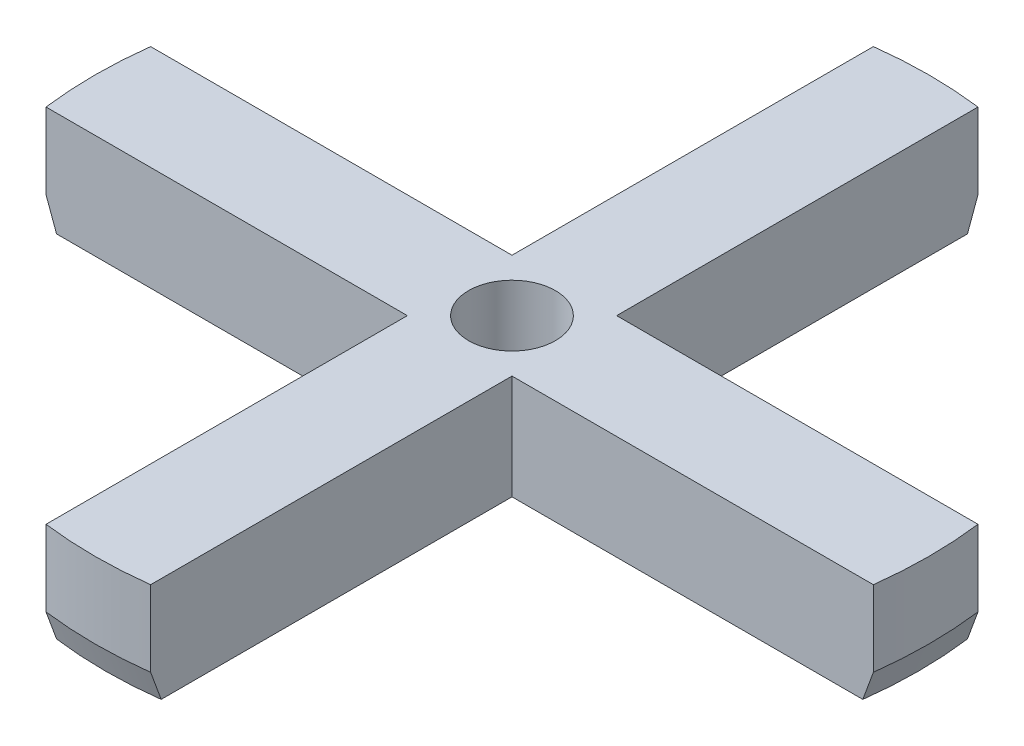
ISO-10303-21;
HEADER;
FILE_DESCRIPTION(('STEP AP214'),'2;1');
FILE_NAME('part.step','',(''),(''),'','','');
FILE_SCHEMA(('AUTOMOTIVE_DESIGN { 1 0 10303 214 1 1 1 1 }'));
ENDSEC;
DATA;
#1=APPLICATION_CONTEXT('core data for automotive mechanical design processes');
#2=APPLICATION_PROTOCOL_DEFINITION('international standard','automotive_design',2000,#1);
#3=PRODUCT_CONTEXT('',#1,'mechanical');
#4=PRODUCT('Part','Part','',(#3));
#5=PRODUCT_RELATED_PRODUCT_CATEGORY('part','',(#4));
#6=PRODUCT_DEFINITION_FORMATION('','',#4);
#7=PRODUCT_DEFINITION_CONTEXT('part definition',#1,'design');
#8=PRODUCT_DEFINITION('design','',#6,#7);
#9=PRODUCT_DEFINITION_SHAPE('','',#8);
#10=(LENGTH_UNIT() NAMED_UNIT(*) SI_UNIT(.MILLI.,.METRE.));
#11=(NAMED_UNIT(*) PLANE_ANGLE_UNIT() SI_UNIT($,.RADIAN.));
#12=(NAMED_UNIT(*) SI_UNIT($,.STERADIAN.) SOLID_ANGLE_UNIT());
#13=UNCERTAINTY_MEASURE_WITH_UNIT(LENGTH_MEASURE(1.E-05),#10,'distance_accuracy_value','');
#14=(GEOMETRIC_REPRESENTATION_CONTEXT(3) GLOBAL_UNCERTAINTY_ASSIGNED_CONTEXT((#13)) GLOBAL_UNIT_ASSIGNED_CONTEXT((#10,
#11,#12)) REPRESENTATION_CONTEXT('',''));
#15=CARTESIAN_POINT('',(0.,0.,0.));
#16=DIRECTION('',(0.,0.,1.));
#17=DIRECTION('',(1.,0.,0.));
#18=AXIS2_PLACEMENT_3D('',#15,#16,#17);
#19=CARTESIAN_POINT('',(0.,10.,0.));
#20=DIRECTION('',(0.,-1.,0.));
#21=DIRECTION('',(0.,0.,-1.));
#22=AXIS2_PLACEMENT_3D('',#19,#20,#21);
#23=PLANE('',#22);
#24=CARTESIAN_POINT('',(0.,10.,0.));
#25=DIRECTION('',(0.,1.,0.));
#26=DIRECTION('',(0.,0.,-1.));
#27=AXIS2_PLACEMENT_3D('',#24,#25,#26);
#28=CIRCLE('',#27,39.85);
#29=CARTESIAN_POINT('',(5.,10.,-39.5350793599811));
#30=VERTEX_POINT('',#29);
#31=CARTESIAN_POINT('',(-5.,10.,-39.5350793599811));
#32=VERTEX_POINT('',#31);
#33=EDGE_CURVE('E163',#30,#32,#28,.T.);
#34=ORIENTED_EDGE('',*,*,#33,.T.);
#35=DIRECTION('',(0.,0.,1.));
#36=VECTOR('',#35,1.);
#37=CARTESIAN_POINT('',(-5.,10.,-5.));
#38=LINE('',#37,#36);
#39=CARTESIAN_POINT('',(-5.,10.,-5.));
#40=VERTEX_POINT('',#39);
#41=EDGE_CURVE('E153',#32,#40,#38,.T.);
#42=ORIENTED_EDGE('',*,*,#41,.T.);
#43=DIRECTION('',(-1.,0.,0.));
#44=VECTOR('',#43,1.);
#45=CARTESIAN_POINT('',(-39.5350793599811,10.,-5.));
#46=LINE('',#45,#44);
#47=CARTESIAN_POINT('',(-39.5350793599811,10.,-5.));
#48=VERTEX_POINT('',#47);
#49=EDGE_CURVE('E162',#40,#48,#46,.T.);
#50=ORIENTED_EDGE('',*,*,#49,.T.);
#51=CARTESIAN_POINT('',(0.,10.,0.));
#52=DIRECTION('',(0.,1.,0.));
#53=DIRECTION('',(0.,0.,-1.));
#54=AXIS2_PLACEMENT_3D('',#51,#52,#53);
#55=CIRCLE('',#54,39.85);
#56=CARTESIAN_POINT('',(-39.5350793599811,10.,5.00000000000002));
#57=VERTEX_POINT('',#56);
#58=EDGE_CURVE('E305',#48,#57,#55,.T.);
#59=ORIENTED_EDGE('',*,*,#58,.T.);
#60=DIRECTION('',(1.,0.,0.));
#61=VECTOR('',#60,1.);
#62=CARTESIAN_POINT('',(-5.,10.,5.));
#63=LINE('',#62,#61);
#64=CARTESIAN_POINT('',(-5.,10.,5.));
#65=VERTEX_POINT('',#64);
#66=EDGE_CURVE('E378',#57,#65,#63,.T.);
#67=ORIENTED_EDGE('',*,*,#66,.T.);
#68=DIRECTION('',(0.,0.,1.));
#69=VECTOR('',#68,1.);
#70=CARTESIAN_POINT('',(-5.,10.,39.5350793599811));
#71=LINE('',#70,#69);
#72=CARTESIAN_POINT('',(-5.,10.,39.5350793599811));
#73=VERTEX_POINT('',#72);
#74=EDGE_CURVE('E376',#65,#73,#71,.T.);
#75=ORIENTED_EDGE('',*,*,#74,.T.);
#76=CARTESIAN_POINT('',(0.,10.,0.));
#77=DIRECTION('',(0.,1.,0.));
#78=DIRECTION('',(0.,0.,1.));
#79=AXIS2_PLACEMENT_3D('',#76,#77,#78);
#80=CIRCLE('',#79,39.85);
#81=CARTESIAN_POINT('',(5.,10.,39.5350793599811));
#82=VERTEX_POINT('',#81);
#83=EDGE_CURVE('E374',#73,#82,#80,.T.);
#84=ORIENTED_EDGE('',*,*,#83,.T.);
#85=DIRECTION('',(0.,0.,-1.));
#86=VECTOR('',#85,1.);
#87=CARTESIAN_POINT('',(5.,10.,5.00000000000001));
#88=LINE('',#87,#86);
#89=CARTESIAN_POINT('',(5.,10.,5.00000000000001));
#90=VERTEX_POINT('',#89);
#91=EDGE_CURVE('E286',#82,#90,#88,.T.);
#92=ORIENTED_EDGE('',*,*,#91,.T.);
#93=DIRECTION('',(1.,0.,0.));
#94=VECTOR('',#93,1.);
#95=CARTESIAN_POINT('',(39.5350793599811,10.,5.));
#96=LINE('',#95,#94);
#97=CARTESIAN_POINT('',(39.5350793599811,10.,5.));
#98=VERTEX_POINT('',#97);
#99=EDGE_CURVE('E371',#90,#98,#96,.T.);
#100=ORIENTED_EDGE('',*,*,#99,.T.);
#101=CARTESIAN_POINT('',(0.,10.,0.));
#102=DIRECTION('',(0.,1.,0.));
#103=DIRECTION('',(0.,0.,1.));
#104=AXIS2_PLACEMENT_3D('',#101,#102,#103);
#105=CIRCLE('',#104,39.85);
#106=CARTESIAN_POINT('',(39.5350793599811,10.,-4.99999999999999));
#107=VERTEX_POINT('',#106);
#108=EDGE_CURVE('E351',#98,#107,#105,.T.);
#109=ORIENTED_EDGE('',*,*,#108,.T.);
#110=DIRECTION('',(-1.,0.,0.));
#111=VECTOR('',#110,1.);
#112=CARTESIAN_POINT('',(5.,10.,-5.));
#113=LINE('',#112,#111);
#114=CARTESIAN_POINT('',(5.,10.,-5.));
#115=VERTEX_POINT('',#114);
#116=EDGE_CURVE('E368',#107,#115,#113,.T.);
#117=ORIENTED_EDGE('',*,*,#116,.T.);
#118=DIRECTION('',(0.,0.,-1.));
#119=VECTOR('',#118,1.);
#120=CARTESIAN_POINT('',(5.,10.,-39.5350793599811));
#121=LINE('',#120,#119);
#122=EDGE_CURVE('E168',#115,#30,#121,.T.);
#123=ORIENTED_EDGE('',*,*,#122,.T.);
#124=EDGE_LOOP('',(#34,#42,#50,#59,#67,#75,#84,#92,#100,#109,#117,#123));
#125=FACE_BOUND('',#124,.T.);
#126=CARTESIAN_POINT('',(0.,10.,0.));
#127=DIRECTION('',(0.,1.,0.));
#128=DIRECTION('',(0.,0.,1.));
#129=AXIS2_PLACEMENT_3D('',#126,#127,#128);
#130=CIRCLE('',#129,4.15);
#131=CARTESIAN_POINT('',(0.,10.,4.15));
#132=VERTEX_POINT('',#131);
#133=EDGE_CURVE('E362',#132,#132,#130,.T.);
#134=ORIENTED_EDGE('',*,*,#133,.F.);
#135=EDGE_LOOP('',(#134));
#136=FACE_BOUND('',#135,.T.);
#137=ADVANCED_FACE('F35',(#125,#136),#23,.F.);
#138=CARTESIAN_POINT('',(0.,0.,0.));
#139=DIRECTION('',(0.,-1.,0.));
#140=DIRECTION('',(0.,0.,-1.));
#141=AXIS2_PLACEMENT_3D('',#138,#139,#140);
#142=PLANE('',#141);
#143=DIRECTION('',(1.,0.,0.));
#144=VECTOR('',#143,1.);
#145=CARTESIAN_POINT('',(-5.,0.,5.));
#146=LINE('',#145,#144);
#147=CARTESIAN_POINT('',(-38.5269061825629,0.,5.));
#148=VERTEX_POINT('',#147);
#149=CARTESIAN_POINT('',(-5.,0.,5.));
#150=VERTEX_POINT('',#149);
#151=EDGE_CURVE('E311',#148,#150,#146,.T.);
#152=ORIENTED_EDGE('',*,*,#151,.F.);
#153=CARTESIAN_POINT('',(0.,0.,0.));
#154=DIRECTION('',(0.,-1.,0.));
#155=DIRECTION('',(0.,0.,-1.));
#156=AXIS2_PLACEMENT_3D('',#153,#154,#155);
#157=CIRCLE('',#156,38.85);
#158=CARTESIAN_POINT('',(-38.5269061825629,0.,-5.));
#159=VERTEX_POINT('',#158);
#160=EDGE_CURVE('E224',#148,#159,#157,.T.);
#161=ORIENTED_EDGE('',*,*,#160,.T.);
#162=DIRECTION('',(-1.,0.,0.));
#163=VECTOR('',#162,1.);
#164=CARTESIAN_POINT('',(-39.5350793599811,0.,-5.));
#165=LINE('',#164,#163);
#166=CARTESIAN_POINT('',(-5.,0.,-5.));
#167=VERTEX_POINT('',#166);
#168=EDGE_CURVE('E320',#167,#159,#165,.T.);
#169=ORIENTED_EDGE('',*,*,#168,.F.);
#170=DIRECTION('',(0.,0.,1.));
#171=VECTOR('',#170,1.);
#172=CARTESIAN_POINT('',(-5.,0.,-5.));
#173=LINE('',#172,#171);
#174=CARTESIAN_POINT('',(-5.,0.,-38.5269061825629));
#175=VERTEX_POINT('',#174);
#176=EDGE_CURVE('E324',#175,#167,#173,.T.);
#177=ORIENTED_EDGE('',*,*,#176,.F.);
#178=CARTESIAN_POINT('',(0.,0.,0.));
#179=DIRECTION('',(0.,-1.,0.));
#180=DIRECTION('',(0.,0.,-1.));
#181=AXIS2_PLACEMENT_3D('',#178,#179,#180);
#182=CIRCLE('',#181,38.85);
#183=CARTESIAN_POINT('',(5.,0.,-38.5269061825629));
#184=VERTEX_POINT('',#183);
#185=EDGE_CURVE('E360',#175,#184,#182,.T.);
#186=ORIENTED_EDGE('',*,*,#185,.T.);
#187=DIRECTION('',(0.,0.,-1.));
#188=VECTOR('',#187,1.);
#189=CARTESIAN_POINT('',(5.,0.,-39.5350793599811));
#190=LINE('',#189,#188);
#191=CARTESIAN_POINT('',(5.,0.,-5.));
#192=VERTEX_POINT('',#191);
#193=EDGE_CURVE('E172',#192,#184,#190,.T.);
#194=ORIENTED_EDGE('',*,*,#193,.F.);
#195=DIRECTION('',(-1.,0.,0.));
#196=VECTOR('',#195,1.);
#197=CARTESIAN_POINT('',(5.,0.,-5.));
#198=LINE('',#197,#196);
#199=CARTESIAN_POINT('',(38.5269061825629,0.,-5.));
#200=VERTEX_POINT('',#199);
#201=EDGE_CURVE('E332',#200,#192,#198,.T.);
#202=ORIENTED_EDGE('',*,*,#201,.F.);
#203=CARTESIAN_POINT('',(0.,0.,0.));
#204=DIRECTION('',(0.,-1.,0.));
#205=DIRECTION('',(0.,0.,-1.));
#206=AXIS2_PLACEMENT_3D('',#203,#204,#205);
#207=CIRCLE('',#206,38.85);
#208=CARTESIAN_POINT('',(38.5269061825629,0.,5.));
#209=VERTEX_POINT('',#208);
#210=EDGE_CURVE('E411',#200,#209,#207,.T.);
#211=ORIENTED_EDGE('',*,*,#210,.T.);
#212=DIRECTION('',(1.,0.,0.));
#213=VECTOR('',#212,1.);
#214=CARTESIAN_POINT('',(39.5350793599811,0.,5.));
#215=LINE('',#214,#213);
#216=CARTESIAN_POINT('',(5.,0.,5.00000000000001));
#217=VERTEX_POINT('',#216);
#218=EDGE_CURVE('E329',#217,#209,#215,.T.);
#219=ORIENTED_EDGE('',*,*,#218,.F.);
#220=DIRECTION('',(0.,0.,-1.));
#221=VECTOR('',#220,1.);
#222=CARTESIAN_POINT('',(5.,0.,5.00000000000001));
#223=LINE('',#222,#221);
#224=CARTESIAN_POINT('',(5.,0.,38.5269061825628));
#225=VERTEX_POINT('',#224);
#226=EDGE_CURVE('E322',#225,#217,#223,.T.);
#227=ORIENTED_EDGE('',*,*,#226,.F.);
#228=CARTESIAN_POINT('',(0.,0.,0.));
#229=DIRECTION('',(0.,-1.,0.));
#230=DIRECTION('',(0.,0.,-1.));
#231=AXIS2_PLACEMENT_3D('',#228,#229,#230);
#232=CIRCLE('',#231,38.85);
#233=CARTESIAN_POINT('',(-5.,0.,38.5269061825628));
#234=VERTEX_POINT('',#233);
#235=EDGE_CURVE('E193',#225,#234,#232,.T.);
#236=ORIENTED_EDGE('',*,*,#235,.T.);
#237=DIRECTION('',(0.,0.,1.));
#238=VECTOR('',#237,1.);
#239=CARTESIAN_POINT('',(-5.,0.,39.5350793599811));
#240=LINE('',#239,#238);
#241=EDGE_CURVE('E319',#150,#234,#240,.T.);
#242=ORIENTED_EDGE('',*,*,#241,.F.);
#243=EDGE_LOOP('',(#152,#161,#169,#177,#186,#194,#202,#211,#219,#227,#236,#242));
#244=FACE_BOUND('',#243,.T.);
#245=CARTESIAN_POINT('',(0.,0.,0.));
#246=DIRECTION('',(0.,1.,0.));
#247=DIRECTION('',(0.,0.,1.));
#248=AXIS2_PLACEMENT_3D('',#245,#246,#247);
#249=CIRCLE('',#248,4.15);
#250=CARTESIAN_POINT('',(0.,0.,4.15));
#251=VERTEX_POINT('',#250);
#252=EDGE_CURVE('E364',#251,#251,#249,.T.);
#253=ORIENTED_EDGE('',*,*,#252,.T.);
#254=EDGE_LOOP('',(#253));
#255=FACE_BOUND('',#254,.T.);
#256=ADVANCED_FACE('F315',(#244,#255),#142,.T.);
#257=CARTESIAN_POINT('',(0.,10.,0.));
#258=DIRECTION('',(0.,-1.,0.));
#259=DIRECTION('',(0.,0.,-1.));
#260=AXIS2_PLACEMENT_3D('',#257,#258,#259);
#261=CYLINDRICAL_SURFACE('',#260,39.85);
#262=DIRECTION('',(0.,-1.,0.));
#263=VECTOR('',#262,1.);
#264=CARTESIAN_POINT('',(5.,10.,-39.5350793599811));
#265=LINE('',#264,#263);
#266=CARTESIAN_POINT('',(5.,2.74747741945455,-39.5350793599811));
#267=VERTEX_POINT('',#266);
#268=EDGE_CURVE('E336',#30,#267,#265,.T.);
#269=ORIENTED_EDGE('',*,*,#268,.T.);
#270=CARTESIAN_POINT('',(0.,2.74747741945455,0.));
#271=DIRECTION('',(0.,-1.,0.));
#272=DIRECTION('',(0.,0.,-1.));
#273=AXIS2_PLACEMENT_3D('',#270,#271,#272);
#274=CIRCLE('',#273,39.85);
#275=CARTESIAN_POINT('',(-5.,2.74747741945455,-39.5350793599811));
#276=VERTEX_POINT('',#275);
#277=EDGE_CURVE('E177',#267,#276,#274,.F.);
#278=ORIENTED_EDGE('',*,*,#277,.T.);
#279=DIRECTION('',(0.,-1.,0.));
#280=VECTOR('',#279,1.);
#281=CARTESIAN_POINT('',(-5.,10.,-39.5350793599811));
#282=LINE('',#281,#280);
#283=EDGE_CURVE('E157',#32,#276,#282,.T.);
#284=ORIENTED_EDGE('',*,*,#283,.F.);
#285=ORIENTED_EDGE('',*,*,#33,.F.);
#286=EDGE_LOOP('',(#269,#278,#284,#285));
#287=FACE_BOUND('',#286,.T.);
#288=ADVANCED_FACE('F175',(#287),#261,.T.);
#289=CARTESIAN_POINT('',(-5.,10.,-5.));
#290=DIRECTION('',(1.,0.,0.));
#291=DIRECTION('',(0.,0.,-1.));
#292=AXIS2_PLACEMENT_3D('',#289,#290,#291);
#293=PLANE('',#292);
#294=ORIENTED_EDGE('',*,*,#283,.T.);
#295=CARTESIAN_POINT('',(-5.,2.74747741945455,-39.5350793599811));
#296=CARTESIAN_POINT('',(-5.,2.28955318332988,-39.3670813815128));
#297=CARTESIAN_POINT('',(-5.,1.83163461364963,-39.1990679608283));
#298=CARTESIAN_POINT('',(-5.,0.915808807164781,-38.8630102350223));
#299=CARTESIAN_POINT('',(-5.,0.457901570360174,-38.6949659299007));
#300=CARTESIAN_POINT('',(-5.,0.,-38.5269061825629));
#301=B_SPLINE_CURVE_WITH_KNOTS('',3,(#295,#296,#297,#298,#299,#300),.UNSPECIFIED.,.F.,.F.,(4,2,
4),(0.,1.46330493537498,2.92660987079226),.UNSPECIFIED.);
#302=EDGE_CURVE('E227',#276,#175,#301,.T.);
#303=ORIENTED_EDGE('',*,*,#302,.T.);
#304=ORIENTED_EDGE('',*,*,#176,.T.);
#305=DIRECTION('',(0.,-1.,0.));
#306=VECTOR('',#305,1.);
#307=CARTESIAN_POINT('',(-5.,10.,-5.));
#308=LINE('',#307,#306);
#309=EDGE_CURVE('E159',#40,#167,#308,.T.);
#310=ORIENTED_EDGE('',*,*,#309,.F.);
#311=ORIENTED_EDGE('',*,*,#41,.F.);
#312=EDGE_LOOP('',(#294,#303,#304,#310,#311));
#313=FACE_BOUND('',#312,.T.);
#314=ADVANCED_FACE('F155',(#313),#293,.F.);
#315=CARTESIAN_POINT('',(-39.5350793599811,10.,-5.));
#316=DIRECTION('',(0.,0.,1.));
#317=DIRECTION('',(1.,0.,0.));
#318=AXIS2_PLACEMENT_3D('',#315,#316,#317);
#319=PLANE('',#318);
#320=ORIENTED_EDGE('',*,*,#168,.T.);
#321=CARTESIAN_POINT('',(-38.5269061825629,0.,-5.));
#322=CARTESIAN_POINT('',(-38.6949659299006,0.457901570360186,-5.));
#323=CARTESIAN_POINT('',(-38.8630102350223,0.915808807164806,-5.));
#324=CARTESIAN_POINT('',(-39.1990679608283,1.83163461364968,-5.));
#325=CARTESIAN_POINT('',(-39.3670813815128,2.28955318332994,-5.));
#326=CARTESIAN_POINT('',(-39.5350793599811,2.74747741945462,-5.));
#327=B_SPLINE_CURVE_WITH_KNOTS('',3,(#321,#322,#323,#324,#325,#326),.UNSPECIFIED.,.F.,.F.,(4,2,
4),(0.,1.46330493541731,2.92660987079233),.UNSPECIFIED.);
#328=CARTESIAN_POINT('',(-39.5350793599811,2.74747741945462,-5.));
#329=VERTEX_POINT('',#328);
#330=EDGE_CURVE('E218',#159,#329,#327,.T.);
#331=ORIENTED_EDGE('',*,*,#330,.T.);
#332=DIRECTION('',(0.,-1.,0.));
#333=VECTOR('',#332,1.);
#334=CARTESIAN_POINT('',(-39.5350793599811,10.,-5.));
#335=LINE('',#334,#333);
#336=EDGE_CURVE('E183',#48,#329,#335,.T.);
#337=ORIENTED_EDGE('',*,*,#336,.F.);
#338=ORIENTED_EDGE('',*,*,#49,.F.);
#339=ORIENTED_EDGE('',*,*,#309,.T.);
#340=EDGE_LOOP('',(#320,#331,#337,#338,#339));
#341=FACE_BOUND('',#340,.T.);
#342=ADVANCED_FACE('F210',(#341),#319,.F.);
#343=CARTESIAN_POINT('',(0.,10.,0.));
#344=DIRECTION('',(0.,-1.,0.));
#345=DIRECTION('',(0.,0.,-1.));
#346=AXIS2_PLACEMENT_3D('',#343,#344,#345);
#347=CYLINDRICAL_SURFACE('',#346,39.85);
#348=ORIENTED_EDGE('',*,*,#336,.T.);
#349=CARTESIAN_POINT('',(0.,2.74747741945462,0.));
#350=DIRECTION('',(0.,-1.,0.));
#351=DIRECTION('',(0.,0.,-1.));
#352=AXIS2_PLACEMENT_3D('',#349,#350,#351);
#353=CIRCLE('',#352,39.85);
#354=CARTESIAN_POINT('',(-39.5350793599811,2.74747741945462,5.00000000000002));
#355=VERTEX_POINT('',#354);
#356=EDGE_CURVE('E178',#329,#355,#353,.F.);
#357=ORIENTED_EDGE('',*,*,#356,.T.);
#358=DIRECTION('',(0.,-1.,0.));
#359=VECTOR('',#358,1.);
#360=CARTESIAN_POINT('',(-39.5350793599811,10.,5.00000000000002));
#361=LINE('',#360,#359);
#362=EDGE_CURVE('E298',#57,#355,#361,.T.);
#363=ORIENTED_EDGE('',*,*,#362,.F.);
#364=ORIENTED_EDGE('',*,*,#58,.F.);
#365=EDGE_LOOP('',(#348,#357,#363,#364));
#366=FACE_BOUND('',#365,.T.);
#367=ADVANCED_FACE('F204',(#366),#347,.T.);
#368=CARTESIAN_POINT('',(-5.,10.,5.));
#369=DIRECTION('',(0.,0.,-1.));
#370=DIRECTION('',(-1.,0.,0.));
#371=AXIS2_PLACEMENT_3D('',#368,#369,#370);
#372=PLANE('',#371);
#373=ORIENTED_EDGE('',*,*,#362,.T.);
#374=CARTESIAN_POINT('',(-39.5350793599811,2.74747741945462,5.00000000000002));
#375=CARTESIAN_POINT('',(-39.3670813815128,2.28955318332993,5.00000000000001));
#376=CARTESIAN_POINT('',(-39.1990679608283,1.83163461364968,5.00000000000001));
#377=CARTESIAN_POINT('',(-38.8630102350223,0.915808807164804,5.));
#378=CARTESIAN_POINT('',(-38.6949659299006,0.457901570360184,5.));
#379=CARTESIAN_POINT('',(-38.5269061825629,0.,5.));
#380=B_SPLINE_CURVE_WITH_KNOTS('',3,(#374,#375,#376,#377,#378,#379),.UNSPECIFIED.,.F.,.F.,(4,2,
4),(0.,1.46330493537502,2.92660987079233),.UNSPECIFIED.);
#381=EDGE_CURVE('E181',#355,#148,#380,.T.);
#382=ORIENTED_EDGE('',*,*,#381,.T.);
#383=ORIENTED_EDGE('',*,*,#151,.T.);
#384=DIRECTION('',(0.,-1.,0.));
#385=VECTOR('',#384,1.);
#386=CARTESIAN_POINT('',(-5.,10.,5.));
#387=LINE('',#386,#385);
#388=EDGE_CURVE('E289',#65,#150,#387,.T.);
#389=ORIENTED_EDGE('',*,*,#388,.F.);
#390=ORIENTED_EDGE('',*,*,#66,.F.);
#391=EDGE_LOOP('',(#373,#382,#383,#389,#390));
#392=FACE_BOUND('',#391,.T.);
#393=ADVANCED_FACE('F199',(#392),#372,.F.);
#394=CARTESIAN_POINT('',(-5.,10.,39.5350793599811));
#395=DIRECTION('',(1.,0.,0.));
#396=DIRECTION('',(0.,0.,-1.));
#397=AXIS2_PLACEMENT_3D('',#394,#395,#396);
#398=PLANE('',#397);
#399=ORIENTED_EDGE('',*,*,#241,.T.);
#400=CARTESIAN_POINT('',(-5.,0.,38.5269061825628));
#401=CARTESIAN_POINT('',(-5.,0.457901570360187,38.6949659299006));
#402=CARTESIAN_POINT('',(-5.,0.915808807164809,38.8630102350223));
#403=CARTESIAN_POINT('',(-5.,1.83163461364969,39.1990679608283));
#404=CARTESIAN_POINT('',(-5.,2.28955318332995,39.3670813815128));
#405=CARTESIAN_POINT('',(-5.,2.74747741945464,39.5350793599811));
#406=B_SPLINE_CURVE_WITH_KNOTS('',3,(#400,#401,#402,#403,#404,#405),.UNSPECIFIED.,.F.,.F.,(4,2,
4),(0.,1.46330493541732,2.92660987079235),.UNSPECIFIED.);
#407=CARTESIAN_POINT('',(-5.,2.74747741945464,39.5350793599811));
#408=VERTEX_POINT('',#407);
#409=EDGE_CURVE('E11',#234,#408,#406,.T.);
#410=ORIENTED_EDGE('',*,*,#409,.T.);
#411=DIRECTION('',(0.,-1.,0.));
#412=VECTOR('',#411,1.);
#413=CARTESIAN_POINT('',(-5.,10.,39.5350793599811));
#414=LINE('',#413,#412);
#415=EDGE_CURVE('E284',#73,#408,#414,.T.);
#416=ORIENTED_EDGE('',*,*,#415,.F.);
#417=ORIENTED_EDGE('',*,*,#74,.F.);
#418=ORIENTED_EDGE('',*,*,#388,.T.);
#419=EDGE_LOOP('',(#399,#410,#416,#417,#418));
#420=FACE_BOUND('',#419,.T.);
#421=ADVANCED_FACE('F203',(#420),#398,.F.);
#422=CARTESIAN_POINT('',(0.,10.,0.));
#423=DIRECTION('',(0.,-1.,0.));
#424=DIRECTION('',(0.,0.,-1.));
#425=AXIS2_PLACEMENT_3D('',#422,#423,#424);
#426=CYLINDRICAL_SURFACE('',#425,39.85);
#427=ORIENTED_EDGE('',*,*,#415,.T.);
#428=CARTESIAN_POINT('',(0.,2.74747741945464,0.));
#429=DIRECTION('',(0.,-1.,0.));
#430=DIRECTION('',(0.,0.,-1.));
#431=AXIS2_PLACEMENT_3D('',#428,#429,#430);
#432=CIRCLE('',#431,39.85);
#433=CARTESIAN_POINT('',(5.,2.74747741945464,39.5350793599811));
#434=VERTEX_POINT('',#433);
#435=EDGE_CURVE('E261',#408,#434,#432,.F.);
#436=ORIENTED_EDGE('',*,*,#435,.T.);
#437=DIRECTION('',(0.,-1.,0.));
#438=VECTOR('',#437,1.);
#439=CARTESIAN_POINT('',(5.,10.,39.5350793599811));
#440=LINE('',#439,#438);
#441=EDGE_CURVE('E282',#82,#434,#440,.T.);
#442=ORIENTED_EDGE('',*,*,#441,.F.);
#443=ORIENTED_EDGE('',*,*,#83,.F.);
#444=EDGE_LOOP('',(#427,#436,#442,#443));
#445=FACE_BOUND('',#444,.T.);
#446=ADVANCED_FACE('F272',(#445),#426,.T.);
#447=CARTESIAN_POINT('',(5.,10.,5.00000000000001));
#448=DIRECTION('',(-1.,0.,0.));
#449=DIRECTION('',(0.,0.,1.));
#450=AXIS2_PLACEMENT_3D('',#447,#448,#449);
#451=PLANE('',#450);
#452=ORIENTED_EDGE('',*,*,#441,.T.);
#453=CARTESIAN_POINT('',(5.,2.74747741945464,39.5350793599811));
#454=CARTESIAN_POINT('',(5.,2.28955318332994,39.3670813815128));
#455=CARTESIAN_POINT('',(5.,1.83163461364969,39.1990679608283));
#456=CARTESIAN_POINT('',(5.,0.915808807164809,38.8630102350223));
#457=CARTESIAN_POINT('',(5.,0.457901570360187,38.6949659299006));
#458=CARTESIAN_POINT('',(5.,0.,38.5269061825628));
#459=B_SPLINE_CURVE_WITH_KNOTS('',3,(#453,#454,#455,#456,#457,#458),.UNSPECIFIED.,.F.,.F.,(4,2,
4),(0.,1.46330493537503,2.92660987079235),.UNSPECIFIED.);
#460=EDGE_CURVE('E48',#434,#225,#459,.T.);
#461=ORIENTED_EDGE('',*,*,#460,.T.);
#462=ORIENTED_EDGE('',*,*,#226,.T.);
#463=DIRECTION('',(0.,-1.,0.));
#464=VECTOR('',#463,1.);
#465=CARTESIAN_POINT('',(5.,10.,5.00000000000001));
#466=LINE('',#465,#464);
#467=EDGE_CURVE('E287',#90,#217,#466,.T.);
#468=ORIENTED_EDGE('',*,*,#467,.F.);
#469=ORIENTED_EDGE('',*,*,#91,.F.);
#470=EDGE_LOOP('',(#452,#461,#462,#468,#469));
#471=FACE_BOUND('',#470,.T.);
#472=ADVANCED_FACE('F268',(#471),#451,.F.);
#473=CARTESIAN_POINT('',(39.5350793599811,10.,5.));
#474=DIRECTION('',(0.,0.,-1.));
#475=DIRECTION('',(-1.,0.,0.));
#476=AXIS2_PLACEMENT_3D('',#473,#474,#475);
#477=PLANE('',#476);
#478=ORIENTED_EDGE('',*,*,#218,.T.);
#479=CARTESIAN_POINT('',(38.5269061825629,0.,5.));
#480=CARTESIAN_POINT('',(38.6949659299007,0.457901570360175,5.));
#481=CARTESIAN_POINT('',(38.8630102350223,0.915808807164786,5.));
#482=CARTESIAN_POINT('',(39.1990679608283,1.83163461364964,5.));
#483=CARTESIAN_POINT('',(39.3670813815128,2.28955318332989,5.));
#484=CARTESIAN_POINT('',(39.5350793599811,2.74747741945457,5.));
#485=B_SPLINE_CURVE_WITH_KNOTS('',3,(#479,#480,#481,#482,#483,#484),.UNSPECIFIED.,.F.,.F.,(4,2,
4),(0.,1.46330493541728,2.92660987079227),.UNSPECIFIED.);
#486=CARTESIAN_POINT('',(39.5350793599811,2.74747741945457,5.));
#487=VERTEX_POINT('',#486);
#488=EDGE_CURVE('E255',#209,#487,#485,.T.);
#489=ORIENTED_EDGE('',*,*,#488,.T.);
#490=DIRECTION('',(0.,-1.,0.));
#491=VECTOR('',#490,1.);
#492=CARTESIAN_POINT('',(39.5350793599811,10.,5.));
#493=LINE('',#492,#491);
#494=EDGE_CURVE('E292',#98,#487,#493,.T.);
#495=ORIENTED_EDGE('',*,*,#494,.F.);
#496=ORIENTED_EDGE('',*,*,#99,.F.);
#497=ORIENTED_EDGE('',*,*,#467,.T.);
#498=EDGE_LOOP('',(#478,#489,#495,#496,#497));
#499=FACE_BOUND('',#498,.T.);
#500=ADVANCED_FACE('F262',(#499),#477,.F.);
#501=CARTESIAN_POINT('',(0.,10.,0.));
#502=DIRECTION('',(0.,-1.,0.));
#503=DIRECTION('',(0.,0.,-1.));
#504=AXIS2_PLACEMENT_3D('',#501,#502,#503);
#505=CYLINDRICAL_SURFACE('',#504,39.85);
#506=ORIENTED_EDGE('',*,*,#494,.T.);
#507=CARTESIAN_POINT('',(0.,2.74747741945457,0.));
#508=DIRECTION('',(0.,-1.,0.));
#509=DIRECTION('',(0.,0.,-1.));
#510=AXIS2_PLACEMENT_3D('',#507,#508,#509);
#511=CIRCLE('',#510,39.85);
#512=CARTESIAN_POINT('',(39.5350793599811,2.74747741945457,-4.99999999999999));
#513=VERTEX_POINT('',#512);
#514=EDGE_CURVE('E350',#487,#513,#511,.F.);
#515=ORIENTED_EDGE('',*,*,#514,.T.);
#516=DIRECTION('',(0.,-1.,0.));
#517=VECTOR('',#516,1.);
#518=CARTESIAN_POINT('',(39.5350793599811,10.,-4.99999999999999));
#519=LINE('',#518,#517);
#520=EDGE_CURVE('E341',#107,#513,#519,.T.);
#521=ORIENTED_EDGE('',*,*,#520,.F.);
#522=ORIENTED_EDGE('',*,*,#108,.F.);
#523=EDGE_LOOP('',(#506,#515,#521,#522));
#524=FACE_BOUND('',#523,.T.);
#525=ADVANCED_FACE('F267',(#524),#505,.T.);
#526=CARTESIAN_POINT('',(5.,10.,-5.));
#527=DIRECTION('',(0.,0.,1.));
#528=DIRECTION('',(1.,0.,0.));
#529=AXIS2_PLACEMENT_3D('',#526,#527,#528);
#530=PLANE('',#529);
#531=ORIENTED_EDGE('',*,*,#520,.T.);
#532=CARTESIAN_POINT('',(39.5350793599811,2.74747741945457,-4.99999999999999));
#533=CARTESIAN_POINT('',(39.3670813815128,2.28955318332989,-5.));
#534=CARTESIAN_POINT('',(39.1990679608283,1.83163461364964,-5.));
#535=CARTESIAN_POINT('',(38.8630102350223,0.915808807164786,-5.));
#536=CARTESIAN_POINT('',(38.6949659299006,0.457901570360176,-5.));
#537=CARTESIAN_POINT('',(38.5269061825629,0.,-5.));
#538=B_SPLINE_CURVE_WITH_KNOTS('',3,(#532,#533,#534,#535,#536,#537),.UNSPECIFIED.,.F.,.F.,(4,2,
4),(0.,1.46330493537499,2.92660987079227),.UNSPECIFIED.);
#539=EDGE_CURVE('E249',#513,#200,#538,.T.);
#540=ORIENTED_EDGE('',*,*,#539,.T.);
#541=ORIENTED_EDGE('',*,*,#201,.T.);
#542=DIRECTION('',(0.,-1.,0.));
#543=VECTOR('',#542,1.);
#544=CARTESIAN_POINT('',(5.,10.,-5.));
#545=LINE('',#544,#543);
#546=EDGE_CURVE('E338',#115,#192,#545,.T.);
#547=ORIENTED_EDGE('',*,*,#546,.F.);
#548=ORIENTED_EDGE('',*,*,#116,.F.);
#549=EDGE_LOOP('',(#531,#540,#541,#547,#548));
#550=FACE_BOUND('',#549,.T.);
#551=ADVANCED_FACE('F393',(#550),#530,.F.);
#552=CARTESIAN_POINT('',(5.,10.,-39.5350793599811));
#553=DIRECTION('',(-1.,0.,0.));
#554=DIRECTION('',(0.,0.,1.));
#555=AXIS2_PLACEMENT_3D('',#552,#553,#554);
#556=PLANE('',#555);
#557=ORIENTED_EDGE('',*,*,#193,.T.);
#558=CARTESIAN_POINT('',(5.,0.,-38.5269061825629));
#559=CARTESIAN_POINT('',(5.,0.457901570360174,-38.6949659299007));
#560=CARTESIAN_POINT('',(5.,0.915808807164782,-38.8630102350223));
#561=CARTESIAN_POINT('',(5.,1.83163461364963,-39.1990679608283));
#562=CARTESIAN_POINT('',(5.,2.28955318332988,-39.3670813815128));
#563=CARTESIAN_POINT('',(5.,2.74747741945455,-39.5350793599811));
#564=B_SPLINE_CURVE_WITH_KNOTS('',3,(#558,#559,#560,#561,#562,#563),.UNSPECIFIED.,.F.,.F.,(4,2,
4),(0.,1.46330493541727,2.92660987079226),.UNSPECIFIED.);
#565=EDGE_CURVE('E232',#184,#267,#564,.T.);
#566=ORIENTED_EDGE('',*,*,#565,.T.);
#567=ORIENTED_EDGE('',*,*,#268,.F.);
#568=ORIENTED_EDGE('',*,*,#122,.F.);
#569=ORIENTED_EDGE('',*,*,#546,.T.);
#570=EDGE_LOOP('',(#557,#566,#567,#568,#569));
#571=FACE_BOUND('',#570,.T.);
#572=ADVANCED_FACE('F357',(#571),#556,.F.);
#573=CARTESIAN_POINT('',(0.,10.,0.));
#574=DIRECTION('',(0.,-1.,0.));
#575=DIRECTION('',(0.,0.,-1.));
#576=AXIS2_PLACEMENT_3D('',#573,#574,#575);
#577=CYLINDRICAL_SURFACE('',#576,4.15);
#578=ORIENTED_EDGE('',*,*,#133,.T.);
#579=EDGE_LOOP('',(#578));
#580=FACE_BOUND('',#579,.T.);
#581=ORIENTED_EDGE('',*,*,#252,.F.);
#582=EDGE_LOOP('',(#581));
#583=FACE_BOUND('',#582,.T.);
#584=ADVANCED_FACE('F385',(#580,#583),#577,.F.);
#585=CARTESIAN_POINT('',(0.,2.74747741945462,0.));
#586=DIRECTION('',(0.,1.,0.));
#587=DIRECTION('',(0.,0.,1.));
#588=AXIS2_PLACEMENT_3D('',#585,#586,#587);
#589=CONICAL_SURFACE('',#588,39.85,0.349065850398869);
#590=ORIENTED_EDGE('',*,*,#330,.F.);
#591=ORIENTED_EDGE('',*,*,#160,.F.);
#592=ORIENTED_EDGE('',*,*,#381,.F.);
#593=ORIENTED_EDGE('',*,*,#356,.F.);
#594=EDGE_LOOP('',(#590,#591,#592,#593));
#595=FACE_BOUND('',#594,.T.);
#596=ADVANCED_FACE('F195',(#595),#589,.T.);
#597=CARTESIAN_POINT('',(0.,2.74747741945455,0.));
#598=DIRECTION('',(0.,1.,0.));
#599=DIRECTION('',(0.,0.,1.));
#600=AXIS2_PLACEMENT_3D('',#597,#598,#599);
#601=CONICAL_SURFACE('',#600,39.85,0.349065850398868);
#602=ORIENTED_EDGE('',*,*,#565,.F.);
#603=ORIENTED_EDGE('',*,*,#185,.F.);
#604=ORIENTED_EDGE('',*,*,#302,.F.);
#605=ORIENTED_EDGE('',*,*,#277,.F.);
#606=EDGE_LOOP('',(#602,#603,#604,#605));
#607=FACE_BOUND('',#606,.T.);
#608=ADVANCED_FACE('F238',(#607),#601,.T.);
#609=CARTESIAN_POINT('',(0.,2.74747741945457,0.));
#610=DIRECTION('',(0.,1.,0.));
#611=DIRECTION('',(0.,0.,1.));
#612=AXIS2_PLACEMENT_3D('',#609,#610,#611);
#613=CONICAL_SURFACE('',#612,39.85,0.349065850398868);
#614=ORIENTED_EDGE('',*,*,#488,.F.);
#615=ORIENTED_EDGE('',*,*,#210,.F.);
#616=ORIENTED_EDGE('',*,*,#539,.F.);
#617=ORIENTED_EDGE('',*,*,#514,.F.);
#618=EDGE_LOOP('',(#614,#615,#616,#617));
#619=FACE_BOUND('',#618,.T.);
#620=ADVANCED_FACE('F241',(#619),#613,.T.);
#621=CARTESIAN_POINT('',(0.,2.74747741945464,0.));
#622=DIRECTION('',(0.,1.,0.));
#623=DIRECTION('',(0.,0.,1.));
#624=AXIS2_PLACEMENT_3D('',#621,#622,#623);
#625=CONICAL_SURFACE('',#624,39.85,0.349065850398869);
#626=ORIENTED_EDGE('',*,*,#409,.F.);
#627=ORIENTED_EDGE('',*,*,#235,.F.);
#628=ORIENTED_EDGE('',*,*,#460,.F.);
#629=ORIENTED_EDGE('',*,*,#435,.F.);
#630=EDGE_LOOP('',(#626,#627,#628,#629));
#631=FACE_BOUND('',#630,.T.);
#632=ADVANCED_FACE('F37',(#631),#625,.T.);
#633=CLOSED_SHELL('',(#137,#256,#288,#314,#342,#367,#393,#421,#446,#472,#500,#525,#551,#572,
#584,#596,#608,#620,#632));
#634=MANIFOLD_SOLID_BREP('B2',#633);
#635=ADVANCED_BREP_SHAPE_REPRESENTATION('',(#18,#634),#14);
#636=SHAPE_DEFINITION_REPRESENTATION(#9,#635);
ENDSEC;
END-ISO-10303-21;
